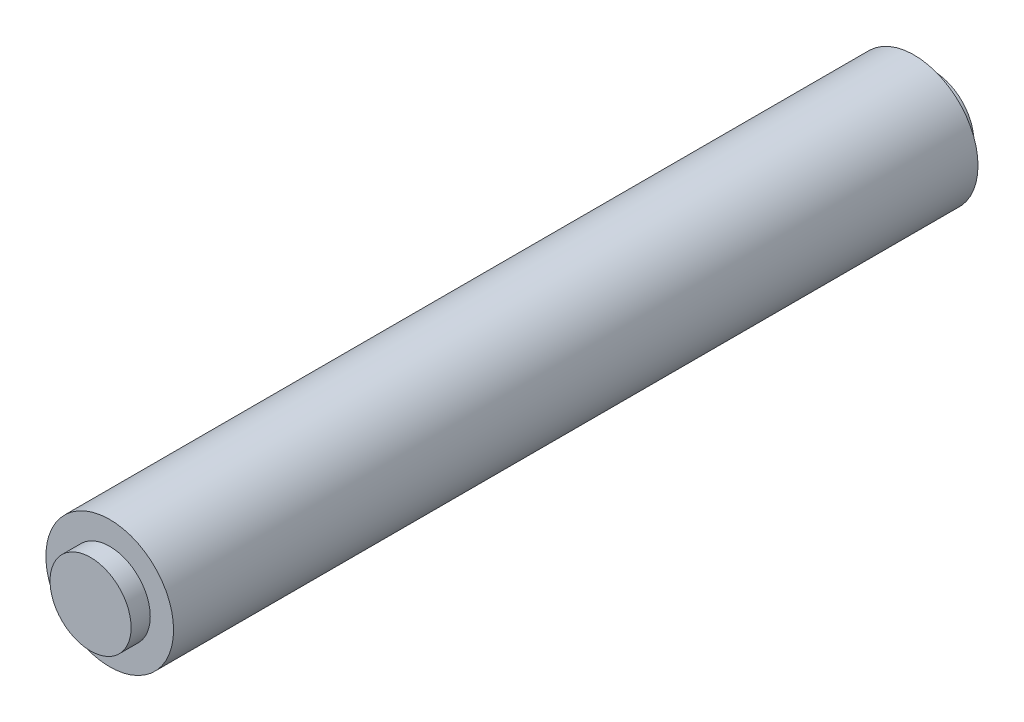
ISO-10303-21;
HEADER;
FILE_DESCRIPTION(('STEP AP214'),'2;1');
FILE_NAME('part.step','',(''),(''),'','','');
FILE_SCHEMA(('AUTOMOTIVE_DESIGN { 1 0 10303 214 1 1 1 1 }'));
ENDSEC;
DATA;
#1=APPLICATION_CONTEXT('core data for automotive mechanical design processes');
#2=APPLICATION_PROTOCOL_DEFINITION('international standard','automotive_design',2000,#1);
#3=PRODUCT_CONTEXT('',#1,'mechanical');
#4=PRODUCT('Part','Part','',(#3));
#5=PRODUCT_RELATED_PRODUCT_CATEGORY('part','',(#4));
#6=PRODUCT_DEFINITION_FORMATION('','',#4);
#7=PRODUCT_DEFINITION_CONTEXT('part definition',#1,'design');
#8=PRODUCT_DEFINITION('design','',#6,#7);
#9=PRODUCT_DEFINITION_SHAPE('','',#8);
#10=(LENGTH_UNIT() NAMED_UNIT(*) SI_UNIT(.MILLI.,.METRE.));
#11=(NAMED_UNIT(*) PLANE_ANGLE_UNIT() SI_UNIT($,.RADIAN.));
#12=(NAMED_UNIT(*) SI_UNIT($,.STERADIAN.) SOLID_ANGLE_UNIT());
#13=UNCERTAINTY_MEASURE_WITH_UNIT(LENGTH_MEASURE(1.E-05),#10,'distance_accuracy_value','');
#14=(GEOMETRIC_REPRESENTATION_CONTEXT(3) GLOBAL_UNCERTAINTY_ASSIGNED_CONTEXT((#13)) GLOBAL_UNIT_ASSIGNED_CONTEXT((#10,
#11,#12)) REPRESENTATION_CONTEXT('',''));
#15=CARTESIAN_POINT('',(0.,0.,0.));
#16=DIRECTION('',(0.,0.,1.));
#17=DIRECTION('',(1.,0.,0.));
#18=AXIS2_PLACEMENT_3D('',#15,#16,#17);
#19=CARTESIAN_POINT('',(0.,0.,31.5));
#20=DIRECTION('',(0.,0.,-1.));
#21=DIRECTION('',(-1.,0.,0.));
#22=AXIS2_PLACEMENT_3D('',#19,#20,#21);
#23=CYLINDRICAL_SURFACE('',#22,5.);
#24=CARTESIAN_POINT('',(0.,0.,31.5));
#25=DIRECTION('',(0.,0.,1.));
#26=DIRECTION('',(1.,0.,0.));
#27=AXIS2_PLACEMENT_3D('',#24,#25,#26);
#28=CIRCLE('',#27,5.);
#29=CARTESIAN_POINT('',(5.,0.,31.5));
#30=VERTEX_POINT('',#29);
#31=EDGE_CURVE('E11',#30,#30,#28,.T.);
#32=ORIENTED_EDGE('',*,*,#31,.F.);
#33=EDGE_LOOP('',(#32));
#34=FACE_BOUND('',#33,.T.);
#35=CARTESIAN_POINT('',(0.,0.,-31.5));
#36=DIRECTION('',(0.,0.,1.));
#37=DIRECTION('',(1.,0.,0.));
#38=AXIS2_PLACEMENT_3D('',#35,#36,#37);
#39=CIRCLE('',#38,5.);
#40=CARTESIAN_POINT('',(5.,0.,-31.5));
#41=VERTEX_POINT('',#40);
#42=EDGE_CURVE('E50',#41,#41,#39,.T.);
#43=ORIENTED_EDGE('',*,*,#42,.T.);
#44=EDGE_LOOP('',(#43));
#45=FACE_BOUND('',#44,.T.);
#46=ADVANCED_FACE('F47',(#34,#45),#23,.T.);
#47=CARTESIAN_POINT('',(0.,0.,31.5));
#48=DIRECTION('',(0.,0.,1.));
#49=DIRECTION('',(1.,0.,0.));
#50=AXIS2_PLACEMENT_3D('',#47,#48,#49);
#51=PLANE('',#50);
#52=ORIENTED_EDGE('',*,*,#31,.T.);
#53=EDGE_LOOP('',(#52));
#54=FACE_BOUND('',#53,.T.);
#55=ADVANCED_FACE('F64',(#54),#51,.T.);
#56=CARTESIAN_POINT('',(0.,0.,-31.5));
#57=DIRECTION('',(0.,0.,1.));
#58=DIRECTION('',(1.,0.,0.));
#59=AXIS2_PLACEMENT_3D('',#56,#57,#58);
#60=PLANE('',#59);
#61=ORIENTED_EDGE('',*,*,#42,.F.);
#62=EDGE_LOOP('',(#61));
#63=FACE_BOUND('',#62,.T.);
#64=ADVANCED_FACE('F62',(#63),#60,.F.);
#65=CLOSED_SHELL('',(#46,#55,#64));
#66=MANIFOLD_SOLID_BREP('B2',#65);
#67=CARTESIAN_POINT('',(0.,0.,33.));
#68=DIRECTION('',(0.,0.,-1.));
#69=DIRECTION('',(-1.,0.,0.));
#70=AXIS2_PLACEMENT_3D('',#67,#68,#69);
#71=CYLINDRICAL_SURFACE('',#70,3.175);
#72=CARTESIAN_POINT('',(0.,0.,33.));
#73=DIRECTION('',(0.,0.,1.));
#74=DIRECTION('',(1.,0.,0.));
#75=AXIS2_PLACEMENT_3D('',#72,#73,#74);
#76=CIRCLE('',#75,3.175);
#77=CARTESIAN_POINT('',(3.175,0.,33.));
#78=VERTEX_POINT('',#77);
#79=EDGE_CURVE('E46',#78,#78,#76,.T.);
#80=ORIENTED_EDGE('',*,*,#79,.F.);
#81=EDGE_LOOP('',(#80));
#82=FACE_BOUND('',#81,.T.);
#83=CARTESIAN_POINT('',(0.,0.,-33.));
#84=DIRECTION('',(0.,0.,1.));
#85=DIRECTION('',(1.,0.,0.));
#86=AXIS2_PLACEMENT_3D('',#83,#84,#85);
#87=CIRCLE('',#86,3.175);
#88=CARTESIAN_POINT('',(3.175,0.,-33.));
#89=VERTEX_POINT('',#88);
#90=EDGE_CURVE('E93',#89,#89,#87,.T.);
#91=ORIENTED_EDGE('',*,*,#90,.T.);
#92=EDGE_LOOP('',(#91));
#93=FACE_BOUND('',#92,.T.);
#94=ADVANCED_FACE('F90',(#82,#93),#71,.T.);
#95=CARTESIAN_POINT('',(0.,0.,33.));
#96=DIRECTION('',(0.,0.,1.));
#97=DIRECTION('',(1.,0.,0.));
#98=AXIS2_PLACEMENT_3D('',#95,#96,#97);
#99=PLANE('',#98);
#100=ORIENTED_EDGE('',*,*,#79,.T.);
#101=EDGE_LOOP('',(#100));
#102=FACE_BOUND('',#101,.T.);
#103=ADVANCED_FACE('F105',(#102),#99,.T.);
#104=CARTESIAN_POINT('',(0.,0.,-33.));
#105=DIRECTION('',(0.,0.,1.));
#106=DIRECTION('',(1.,0.,0.));
#107=AXIS2_PLACEMENT_3D('',#104,#105,#106);
#108=PLANE('',#107);
#109=ORIENTED_EDGE('',*,*,#90,.F.);
#110=EDGE_LOOP('',(#109));
#111=FACE_BOUND('',#110,.T.);
#112=ADVANCED_FACE('F103',(#111),#108,.F.);
#113=CLOSED_SHELL('',(#94,#103,#112));
#114=MANIFOLD_SOLID_BREP('B6',#113);
#115=ADVANCED_BREP_SHAPE_REPRESENTATION('',(#18,#66,#114),#14);
#116=SHAPE_DEFINITION_REPRESENTATION(#9,#115);
ENDSEC;
END-ISO-10303-21;
